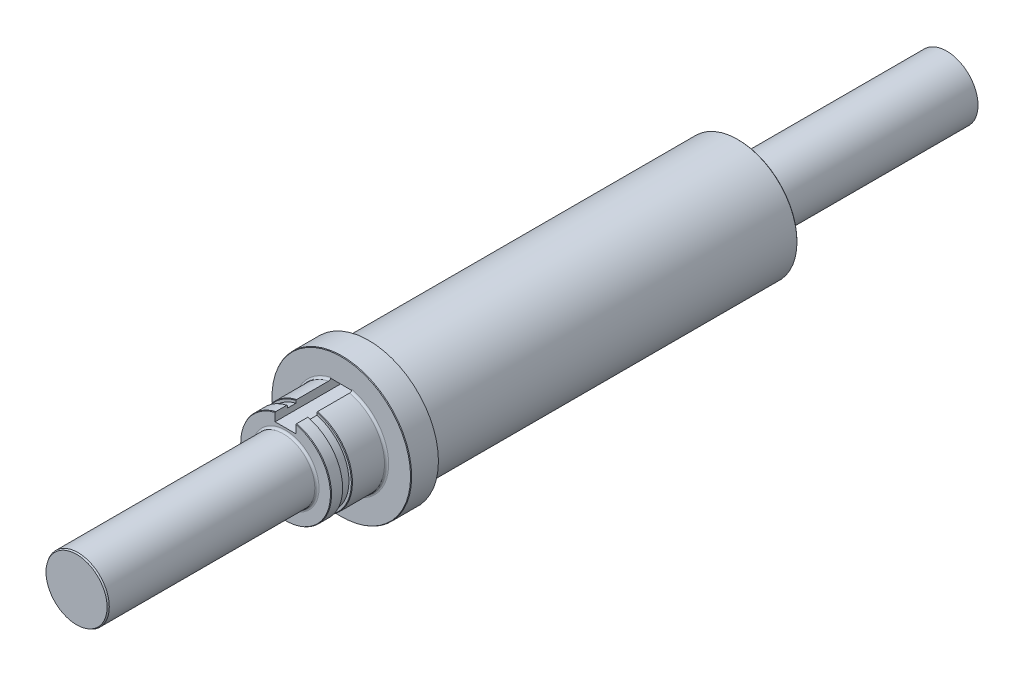
ISO-10303-21;
HEADER;
FILE_DESCRIPTION(('STEP AP214'),'2;1');
FILE_NAME('part.step','',(''),(''),'','','');
FILE_SCHEMA(('AUTOMOTIVE_DESIGN { 1 0 10303 214 1 1 1 1 }'));
ENDSEC;
DATA;
#1=APPLICATION_CONTEXT('core data for automotive mechanical design processes');
#2=APPLICATION_PROTOCOL_DEFINITION('international standard','automotive_design',2000,#1);
#3=PRODUCT_CONTEXT('',#1,'mechanical');
#4=PRODUCT('Part','Part','',(#3));
#5=PRODUCT_RELATED_PRODUCT_CATEGORY('part','',(#4));
#6=PRODUCT_DEFINITION_FORMATION('','',#4);
#7=PRODUCT_DEFINITION_CONTEXT('part definition',#1,'design');
#8=PRODUCT_DEFINITION('design','',#6,#7);
#9=PRODUCT_DEFINITION_SHAPE('','',#8);
#10=(LENGTH_UNIT() NAMED_UNIT(*) SI_UNIT(.MILLI.,.METRE.));
#11=(NAMED_UNIT(*) PLANE_ANGLE_UNIT() SI_UNIT($,.RADIAN.));
#12=(NAMED_UNIT(*) SI_UNIT($,.STERADIAN.) SOLID_ANGLE_UNIT());
#13=UNCERTAINTY_MEASURE_WITH_UNIT(LENGTH_MEASURE(1.E-05),#10,'distance_accuracy_value','');
#14=(GEOMETRIC_REPRESENTATION_CONTEXT(3) GLOBAL_UNCERTAINTY_ASSIGNED_CONTEXT((#13)) GLOBAL_UNIT_ASSIGNED_CONTEXT((#10,
#11,#12)) REPRESENTATION_CONTEXT('',''));
#15=CARTESIAN_POINT('',(0.,0.,0.));
#16=DIRECTION('',(0.,0.,1.));
#17=DIRECTION('',(1.,0.,0.));
#18=AXIS2_PLACEMENT_3D('',#15,#16,#17);
#19=CARTESIAN_POINT('',(-1.5,6.5,-45.));
#20=DIRECTION('',(-1.,0.,0.));
#21=DIRECTION('',(0.,-1.,0.));
#22=AXIS2_PLACEMENT_3D('',#19,#20,#21);
#23=PLANE('',#22);
#24=DIRECTION('',(0.,0.,1.));
#25=VECTOR('',#24,1.);
#26=CARTESIAN_POINT('',(-1.5,5.1,-45.));
#27=LINE('',#26,#25);
#28=CARTESIAN_POINT('',(-1.5,5.1,-42.));
#29=VERTEX_POINT('',#28);
#30=CARTESIAN_POINT('',(-1.5,5.1,-30.));
#31=VERTEX_POINT('',#30);
#32=EDGE_CURVE('E167',#29,#31,#27,.T.);
#33=ORIENTED_EDGE('',*,*,#32,.F.);
#34=DIRECTION('',(0.,-1.,0.));
#35=VECTOR('',#34,1.);
#36=CARTESIAN_POINT('',(-1.5,0.,-42.));
#37=LINE('',#36,#35);
#38=CARTESIAN_POINT('',(-1.5,6.5,-42.));
#39=VERTEX_POINT('',#38);
#40=EDGE_CURVE('E60',#39,#29,#37,.T.);
#41=ORIENTED_EDGE('',*,*,#40,.F.);
#42=DIRECTION('',(0.,0.,1.));
#43=VECTOR('',#42,1.);
#44=CARTESIAN_POINT('',(-1.5,6.5,-45.));
#45=LINE('',#44,#43);
#46=CARTESIAN_POINT('',(-1.5,6.5,-38.));
#47=VERTEX_POINT('',#46);
#48=EDGE_CURVE('E158',#39,#47,#45,.T.);
#49=ORIENTED_EDGE('',*,*,#48,.T.);
#50=DIRECTION('',(0.,-1.,0.));
#51=VECTOR('',#50,1.);
#52=CARTESIAN_POINT('',(-1.5,0.,-38.));
#53=LINE('',#52,#51);
#54=CARTESIAN_POINT('',(-1.5,6.63249575951622,-38.0000000000005));
#55=VERTEX_POINT('',#54);
#56=EDGE_CURVE('E423',#55,#47,#53,.T.);
#57=ORIENTED_EDGE('',*,*,#56,.F.);
#58=CARTESIAN_POINT('',(-1.5,6.32455532033676,-37.7));
#59=CARTESIAN_POINT('',(-1.5,6.32453903183683,-37.716553238349));
#60=CARTESIAN_POINT('',(-1.5,6.32596232798242,-37.7330993876585));
#61=CARTESIAN_POINT('',(-1.5,6.33156438144855,-37.7656923637573));
#62=CARTESIAN_POINT('',(-1.5,6.33573873815369,-37.7817399452011));
#63=CARTESIAN_POINT('',(-1.5,6.34672101624412,-37.8129095079956));
#64=CARTESIAN_POINT('',(-1.5,6.3535294633606,-37.828031303873));
#65=CARTESIAN_POINT('',(-1.5,6.36955801444457,-37.8569366748515));
#66=CARTESIAN_POINT('',(-1.5,6.37877833299269,-37.8707201307329));
#67=CARTESIAN_POINT('',(-1.5,6.39947525804169,-37.8967455606437));
#68=CARTESIAN_POINT('',(-1.5,6.41097768578736,-37.9089669844071));
#69=CARTESIAN_POINT('',(-1.5,6.43582547065724,-37.9313636676768));
#70=CARTESIAN_POINT('',(-1.5,6.44917100345746,-37.9415387319066));
#71=CARTESIAN_POINT('',(-1.5,6.47768690310887,-37.9598268689877));
#72=CARTESIAN_POINT('',(-1.5,6.49289488154221,-37.9678812927223));
#73=CARTESIAN_POINT('',(-1.5,6.52442818849014,-37.9813900776789));
#74=CARTESIAN_POINT('',(-1.5,6.54075385033451,-37.9868436593478));
#75=CARTESIAN_POINT('',(-1.5,6.57444918566688,-37.9951074774921));
#76=CARTESIAN_POINT('',(-1.5,6.59183404908084,-37.9978558069881));
#77=CARTESIAN_POINT('',(-1.5,6.62682566518354,-38.0004402462837));
#78=CARTESIAN_POINT('',(-1.5,6.64443250681044,-38.000275149171));
#79=CARTESIAN_POINT('',(-1.5,6.66190307065475,-37.9986253727531));
#80=B_SPLINE_CURVE_WITH_KNOTS('',3,(#58,#59,#60,#61,#62,#63,#64,#65,#66,#67,#68,#69,#70,#71,#72,
#73,#74,#75,#76,#77,#78,#79),.UNSPECIFIED.,.F.,.F.,(4,2,2,2,2,2,2,2,2,2,4),(0.,
0.0495879486286394,0.0990967679365956,0.148615473681593,0.198138586531624,0.248257766071645,
0.298381726035033,0.349773195383864,0.401180058684568,0.453737717525486,0.506317149343365),.UNSPECIFIED.);
#81=CARTESIAN_POINT('',(-1.5,6.32455532033676,-37.7));
#82=VERTEX_POINT('',#81);
#83=EDGE_CURVE('E429',#55,#82,#80,.F.);
#84=ORIENTED_EDGE('',*,*,#83,.T.);
#85=DIRECTION('',(0.,0.,1.));
#86=VECTOR('',#85,1.);
#87=CARTESIAN_POINT('',(-1.5,6.32455532033676,-95.));
#88=LINE('',#87,#86);
#89=CARTESIAN_POINT('',(-1.5,6.32455532033676,-33.1));
#90=VERTEX_POINT('',#89);
#91=EDGE_CURVE('E316',#82,#90,#88,.T.);
#92=ORIENTED_EDGE('',*,*,#91,.T.);
#93=CARTESIAN_POINT('',(-1.5,6.32455532033676,-33.1));
#94=CARTESIAN_POINT('',(-1.5,6.31466524430173,-33.0833322335719));
#95=CARTESIAN_POINT('',(-1.5,6.30477424178611,-33.0666650170247));
#96=CARTESIAN_POINT('',(-1.5,6.28499038379341,-33.0333316836914));
#97=CARTESIAN_POINT('',(-1.5,6.27509752831634,-33.0166655669053));
#98=CARTESIAN_POINT('',(-1.5,6.26520374635868,-33.));
#99=B_SPLINE_CURVE_WITH_KNOTS('',3,(#93,#94,#95,#96,#97,#98),.UNSPECIFIED.,.F.,.F.,(4,2,4),(0.,
0.0581433774713224,0.116286754944245),.UNSPECIFIED.);
#100=CARTESIAN_POINT('',(-1.5,6.26520374635868,-33.));
#101=VERTEX_POINT('',#100);
#102=EDGE_CURVE('E222',#90,#101,#99,.T.);
#103=ORIENTED_EDGE('',*,*,#102,.T.);
#104=DIRECTION('',(0.,1.,0.));
#105=VECTOR('',#104,1.);
#106=CARTESIAN_POINT('',(-1.5,6.5,-33.));
#107=LINE('',#106,#105);
#108=CARTESIAN_POINT('',(-1.5,5.9126981996378,-33.));
#109=VERTEX_POINT('',#108);
#110=EDGE_CURVE('E338',#109,#101,#107,.T.);
#111=ORIENTED_EDGE('',*,*,#110,.F.);
#112=DIRECTION('',(0.,0.,1.));
#113=VECTOR('',#112,1.);
#114=CARTESIAN_POINT('',(-1.5,5.91269819963779,0.));
#115=LINE('',#114,#113);
#116=CARTESIAN_POINT('',(-1.5,5.91269819963779,-31.75));
#117=VERTEX_POINT('',#116);
#118=EDGE_CURVE('E340',#117,#109,#115,.F.);
#119=ORIENTED_EDGE('',*,*,#118,.F.);
#120=DIRECTION('',(0.,-1.,0.));
#121=VECTOR('',#120,1.);
#122=CARTESIAN_POINT('',(-1.5,6.5,-31.75));
#123=LINE('',#122,#121);
#124=CARTESIAN_POINT('',(-1.5,6.22173609212092,-31.75));
#125=VERTEX_POINT('',#124);
#126=EDGE_CURVE('E336',#125,#117,#123,.T.);
#127=ORIENTED_EDGE('',*,*,#126,.F.);
#128=CARTESIAN_POINT('',(-1.5,6.22173609212092,-31.75));
#129=CARTESIAN_POINT('',(-1.5,6.23887445101876,-31.7403807382495));
#130=CARTESIAN_POINT('',(-1.5,6.25601189948626,-31.7307598551307));
#131=CARTESIAN_POINT('',(-1.5,6.29028497555821,-31.7115148461577));
#132=CARTESIAN_POINT('',(-1.5,6.30742060316265,-31.7018907203035));
#133=CARTESIAN_POINT('',(-1.5,6.32455532033676,-31.692264973081));
#134=B_SPLINE_CURVE_WITH_KNOTS('',3,(#128,#129,#130,#131,#132,#133),.UNSPECIFIED.,.F.,.F.,(4,2,
4),(0.,0.058960001591426,0.117920003174669),.UNSPECIFIED.);
#135=CARTESIAN_POINT('',(-1.5,6.32455532033676,-31.692264973081));
#136=VERTEX_POINT('',#135);
#137=EDGE_CURVE('E229',#125,#136,#134,.T.);
#138=ORIENTED_EDGE('',*,*,#137,.T.);
#139=CARTESIAN_POINT('',(-1.5,6.32455532033676,-30.1));
#140=VERTEX_POINT('',#139);
#141=EDGE_CURVE('E318',#136,#140,#88,.T.);
#142=ORIENTED_EDGE('',*,*,#141,.T.);
#143=CARTESIAN_POINT('',(-1.5,6.32455532033676,-30.1));
#144=CARTESIAN_POINT('',(-1.5,6.31466524430173,-30.0833322335719));
#145=CARTESIAN_POINT('',(-1.5,6.30477424178611,-30.0666650170247));
#146=CARTESIAN_POINT('',(-1.5,6.28499038379341,-30.0333316836914));
#147=CARTESIAN_POINT('',(-1.5,6.27509752831634,-30.0166655669053));
#148=CARTESIAN_POINT('',(-1.5,6.26520374635868,-30.));
#149=B_SPLINE_CURVE_WITH_KNOTS('',3,(#143,#144,#145,#146,#147,#148),.UNSPECIFIED.,.F.,.F.,(4,2,
4),(0.,0.0581433774713198,0.116286754944245),.UNSPECIFIED.);
#150=CARTESIAN_POINT('',(-1.5,6.26520374635868,-30.));
#151=VERTEX_POINT('',#150);
#152=EDGE_CURVE('E212',#140,#151,#149,.T.);
#153=ORIENTED_EDGE('',*,*,#152,.T.);
#154=DIRECTION('',(0.,-1.,0.));
#155=VECTOR('',#154,1.);
#156=CARTESIAN_POINT('',(-1.5,6.5,-30.));
#157=LINE('',#156,#155);
#158=EDGE_CURVE('E334',#151,#31,#157,.T.);
#159=ORIENTED_EDGE('',*,*,#158,.T.);
#160=EDGE_LOOP('',(#33,#41,#49,#57,#84,#92,#103,#111,#119,#127,#138,#142,#153,#159));
#161=FACE_BOUND('',#160,.T.);
#162=ADVANCED_FACE('F45',(#161),#23,.F.);
#163=CARTESIAN_POINT('',(1.5,6.5,-45.));
#164=DIRECTION('',(1.,0.,0.));
#165=DIRECTION('',(0.,1.,0.));
#166=AXIS2_PLACEMENT_3D('',#163,#164,#165);
#167=PLANE('',#166);
#168=DIRECTION('',(0.,1.,0.));
#169=VECTOR('',#168,1.);
#170=CARTESIAN_POINT('',(1.5,0.,-42.));
#171=LINE('',#170,#169);
#172=CARTESIAN_POINT('',(1.5,5.1,-42.));
#173=VERTEX_POINT('',#172);
#174=CARTESIAN_POINT('',(1.5,6.5,-42.));
#175=VERTEX_POINT('',#174);
#176=EDGE_CURVE('E148',#173,#175,#171,.T.);
#177=ORIENTED_EDGE('',*,*,#176,.F.);
#178=DIRECTION('',(0.,0.,1.));
#179=VECTOR('',#178,1.);
#180=CARTESIAN_POINT('',(1.5,5.1,-45.));
#181=LINE('',#180,#179);
#182=CARTESIAN_POINT('',(1.5,5.1,-30.));
#183=VERTEX_POINT('',#182);
#184=EDGE_CURVE('E152',#173,#183,#181,.T.);
#185=ORIENTED_EDGE('',*,*,#184,.T.);
#186=DIRECTION('',(0.,1.,0.));
#187=VECTOR('',#186,1.);
#188=CARTESIAN_POINT('',(1.5,6.5,-30.));
#189=LINE('',#188,#187);
#190=CARTESIAN_POINT('',(1.5,6.26520374635868,-30.));
#191=VERTEX_POINT('',#190);
#192=EDGE_CURVE('E327',#183,#191,#189,.T.);
#193=ORIENTED_EDGE('',*,*,#192,.T.);
#194=CARTESIAN_POINT('',(1.5,6.26520374635868,-30.));
#195=CARTESIAN_POINT('',(1.5,6.27509752831634,-30.0166655669053));
#196=CARTESIAN_POINT('',(1.5,6.28499038379341,-30.0333316836914));
#197=CARTESIAN_POINT('',(1.5,6.30477424178611,-30.0666650170247));
#198=CARTESIAN_POINT('',(1.5,6.31466524430173,-30.0833322335719));
#199=CARTESIAN_POINT('',(1.5,6.32455532033676,-30.1));
#200=B_SPLINE_CURVE_WITH_KNOTS('',3,(#194,#195,#196,#197,#198,#199),.UNSPECIFIED.,.F.,.F.,(4,2,
4),(0.,0.0581433774729256,0.116286754944245),.UNSPECIFIED.);
#201=CARTESIAN_POINT('',(1.5,6.32455532033676,-30.1));
#202=VERTEX_POINT('',#201);
#203=EDGE_CURVE('E264',#191,#202,#200,.T.);
#204=ORIENTED_EDGE('',*,*,#203,.T.);
#205=DIRECTION('',(0.,0.,1.));
#206=VECTOR('',#205,1.);
#207=CARTESIAN_POINT('',(1.5,6.32455532033676,-95.));
#208=LINE('',#207,#206);
#209=CARTESIAN_POINT('',(1.5,6.32455532033676,-31.692264973081));
#210=VERTEX_POINT('',#209);
#211=EDGE_CURVE('E319',#202,#210,#208,.F.);
#212=ORIENTED_EDGE('',*,*,#211,.T.);
#213=CARTESIAN_POINT('',(1.5,6.32455532033676,-31.692264973081));
#214=CARTESIAN_POINT('',(1.5,6.30742060316265,-31.7018907203035));
#215=CARTESIAN_POINT('',(1.5,6.2902849755582,-31.7115148461577));
#216=CARTESIAN_POINT('',(1.5,6.25601189948626,-31.7307598551307));
#217=CARTESIAN_POINT('',(1.5,6.23887445101875,-31.7403807382495));
#218=CARTESIAN_POINT('',(1.5,6.22173609212091,-31.75));
#219=B_SPLINE_CURVE_WITH_KNOTS('',3,(#213,#214,#215,#216,#217,#218),.UNSPECIFIED.,.F.,.F.,(4,2,
4),(0.,0.0589600015832439,0.11792000317467),.UNSPECIFIED.);
#220=CARTESIAN_POINT('',(1.5,6.22173609212092,-31.75));
#221=VERTEX_POINT('',#220);
#222=EDGE_CURVE('E250',#210,#221,#219,.T.);
#223=ORIENTED_EDGE('',*,*,#222,.T.);
#224=DIRECTION('',(0.,1.,0.));
#225=VECTOR('',#224,1.);
#226=CARTESIAN_POINT('',(1.5,6.5,-31.75));
#227=LINE('',#226,#225);
#228=CARTESIAN_POINT('',(1.5,5.91269819963779,-31.75));
#229=VERTEX_POINT('',#228);
#230=EDGE_CURVE('E309',#229,#221,#227,.T.);
#231=ORIENTED_EDGE('',*,*,#230,.F.);
#232=DIRECTION('',(0.,0.,1.));
#233=VECTOR('',#232,1.);
#234=CARTESIAN_POINT('',(1.5,5.91269819963779,0.));
#235=LINE('',#234,#233);
#236=CARTESIAN_POINT('',(1.5,5.91269819963779,-33.));
#237=VERTEX_POINT('',#236);
#238=EDGE_CURVE('E314',#237,#229,#235,.T.);
#239=ORIENTED_EDGE('',*,*,#238,.F.);
#240=DIRECTION('',(0.,-1.,0.));
#241=VECTOR('',#240,1.);
#242=CARTESIAN_POINT('',(1.5,6.5,-33.));
#243=LINE('',#242,#241);
#244=CARTESIAN_POINT('',(1.5,6.26520374635868,-33.));
#245=VERTEX_POINT('',#244);
#246=EDGE_CURVE('E312',#245,#237,#243,.T.);
#247=ORIENTED_EDGE('',*,*,#246,.F.);
#248=CARTESIAN_POINT('',(1.5,6.26520374635868,-33.));
#249=CARTESIAN_POINT('',(1.5,6.27509752831634,-33.0166655669053));
#250=CARTESIAN_POINT('',(1.5,6.28499038379341,-33.0333316836914));
#251=CARTESIAN_POINT('',(1.5,6.30477424178611,-33.0666650170247));
#252=CARTESIAN_POINT('',(1.5,6.31466524430173,-33.0833322335719));
#253=CARTESIAN_POINT('',(1.5,6.32455532033676,-33.1));
#254=B_SPLINE_CURVE_WITH_KNOTS('',3,(#248,#249,#250,#251,#252,#253),.UNSPECIFIED.,.F.,.F.,(4,2,
4),(0.,0.0581433774729218,0.116286754944245),.UNSPECIFIED.);
#255=CARTESIAN_POINT('',(1.5,6.32455532033676,-33.1));
#256=VERTEX_POINT('',#255);
#257=EDGE_CURVE('E271',#245,#256,#254,.T.);
#258=ORIENTED_EDGE('',*,*,#257,.T.);
#259=CARTESIAN_POINT('',(1.5,6.32455532033676,-37.7));
#260=VERTEX_POINT('',#259);
#261=EDGE_CURVE('E321',#256,#260,#208,.F.);
#262=ORIENTED_EDGE('',*,*,#261,.T.);
#263=CARTESIAN_POINT('',(1.5,6.32455532033676,-37.7));
#264=CARTESIAN_POINT('',(1.5,6.32453903183683,-37.716553238349));
#265=CARTESIAN_POINT('',(1.5,6.32596232798242,-37.7330993876585));
#266=CARTESIAN_POINT('',(1.5,6.33156438144855,-37.7656923637573));
#267=CARTESIAN_POINT('',(1.5,6.33573873815369,-37.7817399452011));
#268=CARTESIAN_POINT('',(1.5,6.34672101624412,-37.8129095079956));
#269=CARTESIAN_POINT('',(1.5,6.3535294633606,-37.828031303873));
#270=CARTESIAN_POINT('',(1.5,6.36955801444457,-37.8569366748515));
#271=CARTESIAN_POINT('',(1.5,6.37877833299269,-37.8707201307329));
#272=CARTESIAN_POINT('',(1.5,6.39947525804169,-37.8967455606437));
#273=CARTESIAN_POINT('',(1.5,6.41097768578736,-37.9089669844071));
#274=CARTESIAN_POINT('',(1.5,6.43582547065724,-37.9313636676768));
#275=CARTESIAN_POINT('',(1.5,6.44917100345746,-37.9415387319066));
#276=CARTESIAN_POINT('',(1.5,6.47768690310887,-37.9598268689877));
#277=CARTESIAN_POINT('',(1.5,6.49289488154221,-37.9678812927223));
#278=CARTESIAN_POINT('',(1.5,6.52442818849014,-37.9813900776789));
#279=CARTESIAN_POINT('',(1.5,6.54075385033451,-37.9868436593478));
#280=CARTESIAN_POINT('',(1.5,6.57444918566688,-37.9951074774921));
#281=CARTESIAN_POINT('',(1.5,6.59183404908084,-37.9978558069881));
#282=CARTESIAN_POINT('',(1.5,6.62682566518354,-38.0004402462837));
#283=CARTESIAN_POINT('',(1.5,6.64443250681044,-38.000275149171));
#284=CARTESIAN_POINT('',(1.5,6.66190307065475,-37.9986253727531));
#285=B_SPLINE_CURVE_WITH_KNOTS('',3,(#263,#264,#265,#266,#267,#268,#269,#270,#271,#272,#273,
#274,#275,#276,#277,#278,#279,#280,#281,#282,#283,#284),.UNSPECIFIED.,.F.,.F.,(4,2,2,2,2,2,2,2,
2,2,4),(0.,0.0495879486286394,0.0990967679365956,0.148615473681593,0.198138586531624,
0.248257766071645,0.298381726035033,0.349773195383864,0.401180058684568,0.453737717525486,
0.506317149343365),.UNSPECIFIED.);
#286=CARTESIAN_POINT('',(1.5,6.63249575951622,-38.));
#287=VERTEX_POINT('',#286);
#288=EDGE_CURVE('E433',#260,#287,#285,.T.);
#289=ORIENTED_EDGE('',*,*,#288,.T.);
#290=DIRECTION('',(0.,1.,0.));
#291=VECTOR('',#290,1.);
#292=CARTESIAN_POINT('',(1.5,0.,-38.));
#293=LINE('',#292,#291);
#294=CARTESIAN_POINT('',(1.5,6.5,-38.));
#295=VERTEX_POINT('',#294);
#296=EDGE_CURVE('E68',#295,#287,#293,.T.);
#297=ORIENTED_EDGE('',*,*,#296,.F.);
#298=DIRECTION('',(0.,0.,1.));
#299=VECTOR('',#298,1.);
#300=CARTESIAN_POINT('',(1.5,6.5,-45.));
#301=LINE('',#300,#299);
#302=EDGE_CURVE('E155',#175,#295,#301,.T.);
#303=ORIENTED_EDGE('',*,*,#302,.F.);
#304=EDGE_LOOP('',(#177,#185,#193,#204,#212,#223,#231,#239,#247,#258,#262,#289,#297,#303));
#305=FACE_BOUND('',#304,.T.);
#306=ADVANCED_FACE('F150',(#305),#167,.F.);
#307=CARTESIAN_POINT('',(-1.5,5.1,-45.));
#308=DIRECTION('',(0.,-1.,0.));
#309=DIRECTION('',(0.,0.,-1.));
#310=AXIS2_PLACEMENT_3D('',#307,#308,#309);
#311=PLANE('',#310);
#312=DIRECTION('',(1.,0.,0.));
#313=VECTOR('',#312,1.);
#314=CARTESIAN_POINT('',(-1.5,5.1,-42.));
#315=LINE('',#314,#313);
#316=EDGE_CURVE('E162',#29,#173,#315,.T.);
#317=ORIENTED_EDGE('',*,*,#316,.F.);
#318=ORIENTED_EDGE('',*,*,#32,.T.);
#319=DIRECTION('',(1.,0.,0.));
#320=VECTOR('',#319,1.);
#321=CARTESIAN_POINT('',(-1.5,5.1,-30.));
#322=LINE('',#321,#320);
#323=EDGE_CURVE('E165',#31,#183,#322,.T.);
#324=ORIENTED_EDGE('',*,*,#323,.T.);
#325=ORIENTED_EDGE('',*,*,#184,.F.);
#326=EDGE_LOOP('',(#317,#318,#324,#325));
#327=FACE_BOUND('',#326,.T.);
#328=ADVANCED_FACE('F161',(#327),#311,.F.);
#329=CARTESIAN_POINT('',(0.,0.,-95.));
#330=DIRECTION('',(0.,0.,1.));
#331=DIRECTION('',(1.,0.,0.));
#332=AXIS2_PLACEMENT_3D('',#329,#330,#331);
#333=CYLINDRICAL_SURFACE('',#332,6.5);
#334=ORIENTED_EDGE('',*,*,#141,.F.);
#335=CARTESIAN_POINT('',(0.,0.,-31.692264973081));
#336=DIRECTION('',(0.,0.,-1.));
#337=DIRECTION('',(-1.,0.,0.));
#338=AXIS2_PLACEMENT_3D('',#335,#336,#337);
#339=CIRCLE('',#338,6.5);
#340=EDGE_CURVE('E255',#136,#210,#339,.F.);
#341=ORIENTED_EDGE('',*,*,#340,.T.);
#342=ORIENTED_EDGE('',*,*,#211,.F.);
#343=CARTESIAN_POINT('',(0.,0.,-30.1));
#344=DIRECTION('',(0.,0.,1.));
#345=DIRECTION('',(1.,0.,0.));
#346=AXIS2_PLACEMENT_3D('',#343,#344,#345);
#347=CIRCLE('',#346,6.5);
#348=EDGE_CURVE('E288',#202,#140,#347,.F.);
#349=ORIENTED_EDGE('',*,*,#348,.T.);
#350=EDGE_LOOP('',(#334,#341,#342,#349));
#351=FACE_BOUND('',#350,.T.);
#352=ADVANCED_FACE('F359',(#351),#333,.T.);
#353=ORIENTED_EDGE('',*,*,#91,.F.);
#354=CARTESIAN_POINT('',(0.,0.,-37.7));
#355=DIRECTION('',(0.,0.,1.));
#356=DIRECTION('',(1.,0.,0.));
#357=AXIS2_PLACEMENT_3D('',#354,#355,#356);
#358=CIRCLE('',#357,6.5);
#359=EDGE_CURVE('E432',#82,#260,#358,.T.);
#360=ORIENTED_EDGE('',*,*,#359,.T.);
#361=ORIENTED_EDGE('',*,*,#261,.F.);
#362=CARTESIAN_POINT('',(0.,0.,-33.1));
#363=DIRECTION('',(0.,0.,1.));
#364=DIRECTION('',(1.,0.,0.));
#365=AXIS2_PLACEMENT_3D('',#362,#363,#364);
#366=CIRCLE('',#365,6.5);
#367=EDGE_CURVE('E280',#256,#90,#366,.F.);
#368=ORIENTED_EDGE('',*,*,#367,.T.);
#369=EDGE_LOOP('',(#353,#360,#361,#368));
#370=FACE_BOUND('',#369,.T.);
#371=ADVANCED_FACE('F399',(#370),#333,.T.);
#372=CARTESIAN_POINT('',(0.,0.,-42.));
#373=DIRECTION('',(0.,0.,1.));
#374=DIRECTION('',(1.,0.,0.));
#375=AXIS2_PLACEMENT_3D('',#372,#373,#374);
#376=CYLINDRICAL_SURFACE('',#375,10.);
#377=CARTESIAN_POINT('',(0.,0.,-41.942264973081));
#378=DIRECTION('',(0.,0.,1.));
#379=DIRECTION('',(1.,0.,0.));
#380=AXIS2_PLACEMENT_3D('',#377,#378,#379);
#381=CIRCLE('',#380,10.);
#382=CARTESIAN_POINT('',(10.,0.,-41.942264973081));
#383=VERTEX_POINT('',#382);
#384=EDGE_CURVE('E434',#383,#383,#381,.T.);
#385=ORIENTED_EDGE('',*,*,#384,.T.);
#386=EDGE_LOOP('',(#385));
#387=FACE_BOUND('',#386,.T.);
#388=CARTESIAN_POINT('',(0.,0.,-38.1));
#389=DIRECTION('',(0.,0.,1.));
#390=DIRECTION('',(1.,0.,0.));
#391=AXIS2_PLACEMENT_3D('',#388,#389,#390);
#392=CIRCLE('',#391,10.);
#393=CARTESIAN_POINT('',(10.,0.,-38.1));
#394=VERTEX_POINT('',#393);
#395=EDGE_CURVE('E490',#394,#394,#392,.F.);
#396=ORIENTED_EDGE('',*,*,#395,.T.);
#397=EDGE_LOOP('',(#396));
#398=FACE_BOUND('',#397,.T.);
#399=ADVANCED_FACE('F407',(#387,#398),#376,.T.);
#400=CARTESIAN_POINT('',(0.,0.,-42.));
#401=DIRECTION('',(0.,0.,1.));
#402=DIRECTION('',(1.,0.,0.));
#403=AXIS2_PLACEMENT_3D('',#400,#401,#402);
#404=PLANE('',#403);
#405=CARTESIAN_POINT('',(0.,0.,-42.));
#406=DIRECTION('',(0.,0.,1.));
#407=DIRECTION('',(1.,0.,0.));
#408=AXIS2_PLACEMENT_3D('',#405,#406,#407);
#409=CIRCLE('',#408,8.8);
#410=CARTESIAN_POINT('',(8.8,0.,-42.));
#411=VERTEX_POINT('',#410);
#412=EDGE_CURVE('E13',#411,#411,#409,.T.);
#413=ORIENTED_EDGE('',*,*,#412,.T.);
#414=EDGE_LOOP('',(#413));
#415=FACE_BOUND('',#414,.T.);
#416=CARTESIAN_POINT('',(0.,0.,-42.));
#417=DIRECTION('',(0.,0.,1.));
#418=DIRECTION('',(1.,0.,0.));
#419=AXIS2_PLACEMENT_3D('',#416,#417,#418);
#420=CIRCLE('',#419,9.90000000000001);
#421=CARTESIAN_POINT('',(9.90000000000001,0.,-42.));
#422=VERTEX_POINT('',#421);
#423=EDGE_CURVE('E482',#422,#422,#420,.F.);
#424=ORIENTED_EDGE('',*,*,#423,.T.);
#425=EDGE_LOOP('',(#424));
#426=FACE_BOUND('',#425,.T.);
#427=ADVANCED_FACE('F207',(#415,#426),#404,.F.);
#428=CARTESIAN_POINT('',(0.,0.,-38.));
#429=DIRECTION('',(0.,0.,1.));
#430=DIRECTION('',(1.,0.,0.));
#431=AXIS2_PLACEMENT_3D('',#428,#429,#430);
#432=PLANE('',#431);
#433=CARTESIAN_POINT('',(0.,0.,-38.));
#434=DIRECTION('',(0.,0.,1.));
#435=DIRECTION('',(1.,0.,0.));
#436=AXIS2_PLACEMENT_3D('',#433,#434,#435);
#437=CIRCLE('',#436,9.94226497308104);
#438=CARTESIAN_POINT('',(9.94226497308104,0.,-38.));
#439=VERTEX_POINT('',#438);
#440=EDGE_CURVE('E236',#439,#439,#437,.T.);
#441=ORIENTED_EDGE('',*,*,#440,.T.);
#442=EDGE_LOOP('',(#441));
#443=FACE_BOUND('',#442,.T.);
#444=CARTESIAN_POINT('',(0.,0.,-38.));
#445=DIRECTION('',(0.,0.,1.));
#446=DIRECTION('',(1.,0.,0.));
#447=AXIS2_PLACEMENT_3D('',#444,#445,#446);
#448=CIRCLE('',#447,6.8);
#449=CARTESIAN_POINT('',(1.56923076923077,6.61645787358307,-38.));
#450=VERTEX_POINT('',#449);
#451=EDGE_CURVE('E421',#450,#55,#448,.F.);
#452=ORIENTED_EDGE('',*,*,#451,.T.);
#453=ORIENTED_EDGE('',*,*,#56,.T.);
#454=DIRECTION('',(-1.,0.,0.));
#455=VECTOR('',#454,1.);
#456=CARTESIAN_POINT('',(0.,6.5,-38.));
#457=LINE('',#456,#455);
#458=EDGE_CURVE('E157',#295,#47,#457,.T.);
#459=ORIENTED_EDGE('',*,*,#458,.F.);
#460=ORIENTED_EDGE('',*,*,#296,.T.);
#461=CARTESIAN_POINT('',(0.,0.,-38.));
#462=DIRECTION('',(0.,0.,1.));
#463=DIRECTION('',(1.,0.,0.));
#464=AXIS2_PLACEMENT_3D('',#461,#462,#463);
#465=CIRCLE('',#464,6.8);
#466=EDGE_CURVE('E425',#287,#450,#465,.F.);
#467=ORIENTED_EDGE('',*,*,#466,.T.);
#468=EDGE_LOOP('',(#452,#453,#459,#460,#467));
#469=FACE_BOUND('',#468,.T.);
#470=ADVANCED_FACE('F390',(#443,#469),#432,.T.);
#471=CARTESIAN_POINT('',(0.,0.,0.));
#472=DIRECTION('',(0.,0.,1.));
#473=DIRECTION('',(1.,0.,0.));
#474=AXIS2_PLACEMENT_3D('',#471,#472,#473);
#475=PLANE('',#474);
#476=CARTESIAN_POINT('',(0.,0.,0.));
#477=DIRECTION('',(0.,0.,1.));
#478=DIRECTION('',(1.,0.,0.));
#479=AXIS2_PLACEMENT_3D('',#476,#477,#478);
#480=CIRCLE('',#479,4.38452994616209);
#481=CARTESIAN_POINT('',(-4.38452994616209,0.,0.));
#482=VERTEX_POINT('',#481);
#483=EDGE_CURVE('E177',#482,#482,#480,.T.);
#484=ORIENTED_EDGE('',*,*,#483,.T.);
#485=EDGE_LOOP('',(#484));
#486=FACE_BOUND('',#485,.T.);
#487=ADVANCED_FACE('F385',(#486),#475,.T.);
#488=CARTESIAN_POINT('',(0.,0.,-125.));
#489=DIRECTION('',(0.,0.,1.));
#490=DIRECTION('',(1.,0.,0.));
#491=AXIS2_PLACEMENT_3D('',#488,#489,#490);
#492=CYLINDRICAL_SURFACE('',#491,4.5);
#493=CARTESIAN_POINT('',(0.,0.,-0.199999999999978));
#494=DIRECTION('',(0.,0.,1.));
#495=DIRECTION('',(1.,0.,0.));
#496=AXIS2_PLACEMENT_3D('',#493,#494,#495);
#497=CIRCLE('',#496,4.5);
#498=CARTESIAN_POINT('',(-4.5,0.,-0.199999999999978));
#499=VERTEX_POINT('',#498);
#500=EDGE_CURVE('E171',#499,#499,#497,.F.);
#501=ORIENTED_EDGE('',*,*,#500,.T.);
#502=EDGE_LOOP('',(#501));
#503=FACE_BOUND('',#502,.T.);
#504=CARTESIAN_POINT('',(0.,0.,-29.7));
#505=DIRECTION('',(0.,0.,1.));
#506=DIRECTION('',(1.,0.,0.));
#507=AXIS2_PLACEMENT_3D('',#504,#505,#506);
#508=CIRCLE('',#507,4.5);
#509=CARTESIAN_POINT('',(4.5,0.,-29.7));
#510=VERTEX_POINT('',#509);
#511=EDGE_CURVE('E300',#510,#510,#508,.T.);
#512=ORIENTED_EDGE('',*,*,#511,.T.);
#513=EDGE_LOOP('',(#512));
#514=FACE_BOUND('',#513,.T.);
#515=ADVANCED_FACE('F381',(#503,#514),#492,.T.);
#516=CARTESIAN_POINT('',(0.,0.,-30.));
#517=DIRECTION('',(0.,0.,1.));
#518=DIRECTION('',(1.,0.,0.));
#519=AXIS2_PLACEMENT_3D('',#516,#517,#518);
#520=PLANE('',#519);
#521=CARTESIAN_POINT('',(0.,0.,-30.));
#522=DIRECTION('',(0.,0.,1.));
#523=DIRECTION('',(1.,0.,0.));
#524=AXIS2_PLACEMENT_3D('',#521,#522,#523);
#525=CIRCLE('',#524,4.8);
#526=CARTESIAN_POINT('',(4.8,0.,-30.));
#527=VERTEX_POINT('',#526);
#528=EDGE_CURVE('E304',#527,#527,#525,.F.);
#529=ORIENTED_EDGE('',*,*,#528,.T.);
#530=EDGE_LOOP('',(#529));
#531=FACE_BOUND('',#530,.T.);
#532=ORIENTED_EDGE('',*,*,#158,.F.);
#533=CARTESIAN_POINT('',(0.,0.,-30.));
#534=DIRECTION('',(0.,0.,1.));
#535=DIRECTION('',(1.,0.,0.));
#536=AXIS2_PLACEMENT_3D('',#533,#534,#535);
#537=CIRCLE('',#536,6.44226497308104);
#538=EDGE_CURVE('E297',#151,#191,#537,.T.);
#539=ORIENTED_EDGE('',*,*,#538,.T.);
#540=ORIENTED_EDGE('',*,*,#192,.F.);
#541=ORIENTED_EDGE('',*,*,#323,.F.);
#542=EDGE_LOOP('',(#532,#539,#540,#541));
#543=FACE_BOUND('',#542,.T.);
#544=ADVANCED_FACE('F384',(#531,#543),#520,.T.);
#545=CARTESIAN_POINT('',(1.5,6.5,-45.));
#546=DIRECTION('',(0.,1.,0.));
#547=DIRECTION('',(0.,0.,1.));
#548=AXIS2_PLACEMENT_3D('',#545,#546,#547);
#549=PLANE('',#548);
#550=ORIENTED_EDGE('',*,*,#302,.T.);
#551=ORIENTED_EDGE('',*,*,#458,.T.);
#552=ORIENTED_EDGE('',*,*,#48,.F.);
#553=DIRECTION('',(-1.,0.,0.));
#554=VECTOR('',#553,1.);
#555=CARTESIAN_POINT('',(0.,6.5,-42.));
#556=LINE('',#555,#554);
#557=EDGE_CURVE('E323',#175,#39,#556,.T.);
#558=ORIENTED_EDGE('',*,*,#557,.F.);
#559=EDGE_LOOP('',(#550,#551,#552,#558));
#560=FACE_BOUND('',#559,.T.);
#561=ADVANCED_FACE('F259',(#560),#549,.F.);
#562=CARTESIAN_POINT('',(-6.1,0.,-31.75));
#563=DIRECTION('',(0.,0.,-1.));
#564=DIRECTION('',(-1.,0.,0.));
#565=AXIS2_PLACEMENT_3D('',#562,#563,#564);
#566=PLANE('',#565);
#567=ORIENTED_EDGE('',*,*,#230,.T.);
#568=CARTESIAN_POINT('',(0.,0.,-31.75));
#569=DIRECTION('',(0.,0.,-1.));
#570=DIRECTION('',(-1.,0.,0.));
#571=AXIS2_PLACEMENT_3D('',#568,#569,#570);
#572=CIRCLE('',#571,6.4);
#573=EDGE_CURVE('E237',#221,#125,#572,.T.);
#574=ORIENTED_EDGE('',*,*,#573,.T.);
#575=ORIENTED_EDGE('',*,*,#126,.T.);
#576=CARTESIAN_POINT('',(0.,0.,-31.75));
#577=DIRECTION('',(0.,0.,1.));
#578=DIRECTION('',(1.,0.,0.));
#579=AXIS2_PLACEMENT_3D('',#576,#577,#578);
#580=CIRCLE('',#579,6.1);
#581=EDGE_CURVE('E345',#117,#229,#580,.T.);
#582=ORIENTED_EDGE('',*,*,#581,.T.);
#583=EDGE_LOOP('',(#567,#574,#575,#582));
#584=FACE_BOUND('',#583,.T.);
#585=ADVANCED_FACE('F350',(#584),#566,.T.);
#586=CARTESIAN_POINT('',(-7.5,0.,-33.));
#587=DIRECTION('',(0.,0.,1.));
#588=DIRECTION('',(1.,0.,0.));
#589=AXIS2_PLACEMENT_3D('',#586,#587,#588);
#590=PLANE('',#589);
#591=ORIENTED_EDGE('',*,*,#110,.T.);
#592=CARTESIAN_POINT('',(0.,0.,-33.));
#593=DIRECTION('',(0.,0.,1.));
#594=DIRECTION('',(1.,0.,0.));
#595=AXIS2_PLACEMENT_3D('',#592,#593,#594);
#596=CIRCLE('',#595,6.44226497308104);
#597=EDGE_CURVE('E275',#101,#245,#596,.T.);
#598=ORIENTED_EDGE('',*,*,#597,.T.);
#599=ORIENTED_EDGE('',*,*,#246,.T.);
#600=CARTESIAN_POINT('',(0.,0.,-33.));
#601=DIRECTION('',(0.,0.,1.));
#602=DIRECTION('',(1.,0.,0.));
#603=AXIS2_PLACEMENT_3D('',#600,#601,#602);
#604=CIRCLE('',#603,6.1);
#605=EDGE_CURVE('E342',#109,#237,#604,.T.);
#606=ORIENTED_EDGE('',*,*,#605,.F.);
#607=EDGE_LOOP('',(#591,#598,#599,#606));
#608=FACE_BOUND('',#607,.T.);
#609=ADVANCED_FACE('F362',(#608),#590,.T.);
#610=CARTESIAN_POINT('',(0.,0.,0.));
#611=DIRECTION('',(0.,0.,1.));
#612=DIRECTION('',(1.,0.,0.));
#613=AXIS2_PLACEMENT_3D('',#610,#611,#612);
#614=CYLINDRICAL_SURFACE('',#613,6.1);
#615=ORIENTED_EDGE('',*,*,#118,.T.);
#616=ORIENTED_EDGE('',*,*,#605,.T.);
#617=ORIENTED_EDGE('',*,*,#238,.T.);
#618=ORIENTED_EDGE('',*,*,#581,.F.);
#619=EDGE_LOOP('',(#615,#616,#617,#618));
#620=FACE_BOUND('',#619,.T.);
#621=ADVANCED_FACE('F361',(#620),#614,.T.);
#622=CARTESIAN_POINT('',(0.,0.,-29.7));
#623=DIRECTION('',(0.,0.,1.));
#624=DIRECTION('',(1.,0.,0.));
#625=AXIS2_PLACEMENT_3D('',#622,#623,#624);
#626=TOROIDAL_SURFACE('',#625,4.8,0.3);
#627=ORIENTED_EDGE('',*,*,#511,.F.);
#628=EDGE_LOOP('',(#627));
#629=FACE_BOUND('',#628,.T.);
#630=ORIENTED_EDGE('',*,*,#528,.F.);
#631=EDGE_LOOP('',(#630));
#632=FACE_BOUND('',#631,.T.);
#633=ADVANCED_FACE('F371',(#629,#632),#626,.F.);
#634=CARTESIAN_POINT('',(0.,0.,-30.));
#635=DIRECTION('',(0.,0.,-1.));
#636=DIRECTION('',(-1.,0.,0.));
#637=AXIS2_PLACEMENT_3D('',#634,#635,#636);
#638=CONICAL_SURFACE('',#637,6.44226497308104,0.523598775598305);
#639=ORIENTED_EDGE('',*,*,#152,.F.);
#640=ORIENTED_EDGE('',*,*,#348,.F.);
#641=ORIENTED_EDGE('',*,*,#203,.F.);
#642=ORIENTED_EDGE('',*,*,#538,.F.);
#643=EDGE_LOOP('',(#639,#640,#641,#642));
#644=FACE_BOUND('',#643,.T.);
#645=ADVANCED_FACE('F367',(#644),#638,.T.);
#646=CARTESIAN_POINT('',(0.,0.,-33.1));
#647=DIRECTION('',(0.,0.,-1.));
#648=DIRECTION('',(-1.,0.,0.));
#649=AXIS2_PLACEMENT_3D('',#646,#647,#648);
#650=CONICAL_SURFACE('',#649,6.5,0.523598775598292);
#651=ORIENTED_EDGE('',*,*,#257,.F.);
#652=ORIENTED_EDGE('',*,*,#597,.F.);
#653=ORIENTED_EDGE('',*,*,#102,.F.);
#654=ORIENTED_EDGE('',*,*,#367,.F.);
#655=EDGE_LOOP('',(#651,#652,#653,#654));
#656=FACE_BOUND('',#655,.T.);
#657=ADVANCED_FACE('F245',(#656),#650,.T.);
#658=CARTESIAN_POINT('',(0.,0.,-31.692264973081));
#659=DIRECTION('',(0.,0.,1.));
#660=DIRECTION('',(1.,0.,0.));
#661=AXIS2_PLACEMENT_3D('',#658,#659,#660);
#662=CONICAL_SURFACE('',#661,6.5,1.04719755119653);
#663=ORIENTED_EDGE('',*,*,#137,.F.);
#664=ORIENTED_EDGE('',*,*,#573,.F.);
#665=ORIENTED_EDGE('',*,*,#222,.F.);
#666=ORIENTED_EDGE('',*,*,#340,.F.);
#667=EDGE_LOOP('',(#663,#664,#665,#666));
#668=FACE_BOUND('',#667,.T.);
#669=ADVANCED_FACE('F240',(#668),#662,.T.);
#670=CARTESIAN_POINT('',(0.,0.,-38.));
#671=DIRECTION('',(0.,0.,-1.));
#672=DIRECTION('',(-1.,0.,0.));
#673=AXIS2_PLACEMENT_3D('',#670,#671,#672);
#674=CONICAL_SURFACE('',#673,9.94226497308104,0.523598775598189);
#675=ORIENTED_EDGE('',*,*,#395,.F.);
#676=EDGE_LOOP('',(#675));
#677=FACE_BOUND('',#676,.T.);
#678=ORIENTED_EDGE('',*,*,#440,.F.);
#679=EDGE_LOOP('',(#678));
#680=FACE_BOUND('',#679,.T.);
#681=ADVANCED_FACE('F244',(#677,#680),#674,.T.);
#682=CARTESIAN_POINT('',(0.,0.,-37.7));
#683=DIRECTION('',(0.,0.,1.));
#684=DIRECTION('',(1.,0.,0.));
#685=AXIS2_PLACEMENT_3D('',#682,#683,#684);
#686=TOROIDAL_SURFACE('',#685,6.8,0.3);
#687=ORIENTED_EDGE('',*,*,#288,.F.);
#688=ORIENTED_EDGE('',*,*,#359,.F.);
#689=ORIENTED_EDGE('',*,*,#83,.F.);
#690=ORIENTED_EDGE('',*,*,#451,.F.);
#691=ORIENTED_EDGE('',*,*,#466,.F.);
#692=EDGE_LOOP('',(#687,#688,#689,#690,#691));
#693=FACE_BOUND('',#692,.T.);
#694=ADVANCED_FACE('F431',(#693),#686,.F.);
#695=CARTESIAN_POINT('',(0.,0.,-41.942264973081));
#696=DIRECTION('',(0.,0.,1.));
#697=DIRECTION('',(1.,0.,0.));
#698=AXIS2_PLACEMENT_3D('',#695,#696,#697);
#699=CONICAL_SURFACE('',#698,10.,1.04719755119652);
#700=ORIENTED_EDGE('',*,*,#423,.F.);
#701=EDGE_LOOP('',(#700));
#702=FACE_BOUND('',#701,.T.);
#703=ORIENTED_EDGE('',*,*,#384,.F.);
#704=EDGE_LOOP('',(#703));
#705=FACE_BOUND('',#704,.T.);
#706=ADVANCED_FACE('F447',(#702,#705),#699,.T.);
#707=CARTESIAN_POINT('',(0.,0.,0.));
#708=DIRECTION('',(0.,0.,-1.));
#709=DIRECTION('',(-1.,0.,0.));
#710=AXIS2_PLACEMENT_3D('',#707,#708,#709);
#711=CONICAL_SURFACE('',#710,4.38452994616209,0.523598775598284);
#712=CARTESIAN_POINT('',(-4.5,0.,-0.199999999999978));
#713=CARTESIAN_POINT('',(-4.49879718693919,0.,-0.197916666666645));
#714=CARTESIAN_POINT('',(-4.49759437387838,0.,-0.195833333333312));
#715=CARTESIAN_POINT('',(-4.49518874775675,0.,-0.191666666666646));
#716=CARTESIAN_POINT('',(-4.49398593469594,0.,-0.189583333333312));
#717=CARTESIAN_POINT('',(-4.49158030857432,0.,-0.185416666666646));
#718=CARTESIAN_POINT('',(-4.49037749551351,0.,-0.183333333333313));
#719=CARTESIAN_POINT('',(-4.48797186939188,0.,-0.179166666666647));
#720=CARTESIAN_POINT('',(-4.48676905633107,0.,-0.177083333333314));
#721=CARTESIAN_POINT('',(-4.48436343020945,0.,-0.172916666666648));
#722=CARTESIAN_POINT('',(-4.48316061714864,0.,-0.170833333333315));
#723=CARTESIAN_POINT('',(-4.48075499102701,0.,-0.166666666666648));
#724=CARTESIAN_POINT('',(-4.4795521779662,0.,-0.164583333333315));
#725=CARTESIAN_POINT('',(-4.47714655184458,0.,-0.160416666666649));
#726=CARTESIAN_POINT('',(-4.47594373878377,0.,-0.158333333333316));
#727=CARTESIAN_POINT('',(-4.47353811266214,0.,-0.15416666666665));
#728=CARTESIAN_POINT('',(-4.47233529960133,0.,-0.152083333333317));
#729=CARTESIAN_POINT('',(-4.46992967347971,0.,-0.14791666666665));
#730=CARTESIAN_POINT('',(-4.4687268604189,0.,-0.145833333333317));
#731=CARTESIAN_POINT('',(-4.46632123429728,0.,-0.141666666666651));
#732=CARTESIAN_POINT('',(-4.46511842123646,0.,-0.139583333333318));
#733=CARTESIAN_POINT('',(-4.46271279511484,0.,-0.135416666666652));
#734=CARTESIAN_POINT('',(-4.46150998205403,0.,-0.133333333333319));
#735=CARTESIAN_POINT('',(-4.45910435593241,0.,-0.129166666666652));
#736=CARTESIAN_POINT('',(-4.4579015428716,0.,-0.127083333333319));
#737=CARTESIAN_POINT('',(-4.45549591674997,0.,-0.122916666666653));
#738=CARTESIAN_POINT('',(-4.45429310368916,0.,-0.12083333333332));
#739=CARTESIAN_POINT('',(-4.45188747756754,0.,-0.116666666666654));
#740=CARTESIAN_POINT('',(-4.45068466450673,0.,-0.114583333333321));
#741=CARTESIAN_POINT('',(-4.4482790383851,0.,-0.110416666666655));
#742=CARTESIAN_POINT('',(-4.44707622532429,0.,-0.108333333333321));
#743=CARTESIAN_POINT('',(-4.44467059920267,0.,-0.104166666666655));
#744=CARTESIAN_POINT('',(-4.44346778614186,0.,-0.102083333333322));
#745=CARTESIAN_POINT('',(-4.44106216002023,0.,-0.0979166666666558));
#746=CARTESIAN_POINT('',(-4.43985934695942,0.,-0.0958333333333228));
#747=CARTESIAN_POINT('',(-4.4374537208378,0.,-0.0916666666666566));
#748=CARTESIAN_POINT('',(-4.43625090777699,0.,-0.0895833333333235));
#749=CARTESIAN_POINT('',(-4.43384528165536,0.,-0.0854166666666573));
#750=CARTESIAN_POINT('',(-4.43264246859455,0.,-0.0833333333333242));
#751=CARTESIAN_POINT('',(-4.43023684247293,0.,-0.079166666666658));
#752=CARTESIAN_POINT('',(-4.42903402941212,0.,-0.0770833333333249));
#753=CARTESIAN_POINT('',(-4.4266284032905,0.,-0.0729166666666586));
#754=CARTESIAN_POINT('',(-4.42542559022968,0.,-0.0708333333333255));
#755=CARTESIAN_POINT('',(-4.42301996410806,0.,-0.0666666666666594));
#756=CARTESIAN_POINT('',(-4.42181715104725,0.,-0.0645833333333263));
#757=CARTESIAN_POINT('',(-4.41941152492563,0.,-0.0604166666666601));
#758=CARTESIAN_POINT('',(-4.41820871186481,0.,-0.0583333333333269));
#759=CARTESIAN_POINT('',(-4.41580308574319,0.,-0.0541666666666606));
#760=CARTESIAN_POINT('',(-4.41460027268238,0.,-0.0520833333333276));
#761=CARTESIAN_POINT('',(-4.41219464656076,0.,-0.0479166666666614));
#762=CARTESIAN_POINT('',(-4.41099183349995,0.,-0.0458333333333283));
#763=CARTESIAN_POINT('',(-4.40858620737832,0.,-0.0416666666666621));
#764=CARTESIAN_POINT('',(-4.40738339431751,0.,-0.039583333333329));
#765=CARTESIAN_POINT('',(-4.40497776819589,0.,-0.0354166666666628));
#766=CARTESIAN_POINT('',(-4.40377495513508,0.,-0.0333333333333296));
#767=CARTESIAN_POINT('',(-4.40136932901345,0.,-0.0291666666666635));
#768=CARTESIAN_POINT('',(-4.40016651595264,0.,-0.0270833333333304));
#769=CARTESIAN_POINT('',(-4.39776088983102,0.,-0.0229166666666642));
#770=CARTESIAN_POINT('',(-4.39655807677021,0.,-0.020833333333331));
#771=CARTESIAN_POINT('',(-4.39415245064858,0.,-0.0166666666666648));
#772=CARTESIAN_POINT('',(-4.39294963758777,0.,-0.0145833333333317));
#773=CARTESIAN_POINT('',(-4.39054401146615,0.,-0.0104166666666655));
#774=CARTESIAN_POINT('',(-4.38934119840534,0.,-0.00833333333333243));
#775=CARTESIAN_POINT('',(-4.38693557228371,0.,-0.0041666666666662));
#776=CARTESIAN_POINT('',(-4.3857327592229,0.,-0.00208333333333308));
#777=CARTESIAN_POINT('',(-4.38452994616209,0.,0.));
#778=B_SPLINE_CURVE_WITH_KNOTS('',3,(#712,#713,#714,#715,#716,#717,#718,#719,#720,#721,#722,
#723,#724,#725,#726,#727,#728,#729,#730,#731,#732,#733,#734,#735,#736,#737,#738,#739,#740,#741,
#742,#743,#744,#745,#746,#747,#748,#749,#750,#751,#752,#753,#754,#755,#756,#757,#758,#759,#760,
#761,#762,#763,#764,#765,#766,#767,#768,#769,#770,#771,#772,#773,#774,#775,#776,#777),
.UNSPECIFIED.,.F.,.F.,(4,2,2,2,2,2,2,2,2,2,2,2,2,2,2,2,2,2,2,2,2,2,2,2,2,2,2,2,2,2,2,2,4),(0.,
0.00721687836486953,0.0144337567297391,0.0216506350946086,0.0288675134594777,0.0360843918243472,
0.0433012701892168,0.0505181485540863,0.0577350269189558,0.0649519052838254,0.0721687836486945,
0.079385662013564,0.0866025403784336,0.0938194187433031,0.101036297108173,0.108253175473042,
0.115470053837911,0.122686932202781,0.12990381056765,0.13712068893252,0.144337567297389,
0.151554445662259,0.158771324027128,0.165988202391997,0.173205080756867,0.180421959121737,
0.187638837486606,0.194855715851476,0.202072594216345,0.209289472581214,0.216506350946084,
0.223723229310953,0.230940107675823),.UNSPECIFIED.);
#779=EDGE_CURVE('BSEAM451',#499,#482,#778,.T.);
#780=ORIENTED_EDGE('',*,*,#500,.F.);
#781=ORIENTED_EDGE('',*,*,#483,.F.);
#782=ORIENTED_EDGE('',*,*,#779,.T.);
#783=ORIENTED_EDGE('',*,*,#779,.F.);
#784=EDGE_LOOP('',(#780,#782,#781,#783));
#785=FACE_BOUND('',#784,.T.);
#786=ADVANCED_FACE('F451',(#785),#711,.T.);
#787=CARTESIAN_POINT('',(0.,0.,-42.));
#788=DIRECTION('',(0.,0.,-1.));
#789=DIRECTION('',(-1.,0.,0.));
#790=AXIS2_PLACEMENT_3D('',#787,#788,#789);
#791=PLANE('',#790);
#792=ORIENTED_EDGE('',*,*,#316,.T.);
#793=ORIENTED_EDGE('',*,*,#176,.T.);
#794=ORIENTED_EDGE('',*,*,#557,.T.);
#795=ORIENTED_EDGE('',*,*,#40,.T.);
#796=EDGE_LOOP('',(#792,#793,#794,#795));
#797=FACE_BOUND('',#796,.T.);
#798=ADVANCED_FACE('F169',(#797),#791,.F.);
#799=CARTESIAN_POINT('',(0.,0.,-119.041630560343));
#800=DIRECTION('',(0.,0.,1.));
#801=DIRECTION('',(1.,0.,0.));
#802=AXIS2_PLACEMENT_3D('',#799,#800,#801);
#803=CYLINDRICAL_SURFACE('',#802,8.5);
#804=CARTESIAN_POINT('',(0.,0.,-42.3));
#805=DIRECTION('',(0.,0.,1.));
#806=DIRECTION('',(1.,0.,0.));
#807=AXIS2_PLACEMENT_3D('',#804,#805,#806);
#808=CIRCLE('',#807,8.5);
#809=CARTESIAN_POINT('',(8.5,0.,-42.3));
#810=VERTEX_POINT('',#809);
#811=EDGE_CURVE('E53',#810,#810,#808,.F.);
#812=CARTESIAN_POINT('',(0.,0.,-94.9));
#813=DIRECTION('',(0.,0.,1.));
#814=DIRECTION('',(1.,0.,0.));
#815=AXIS2_PLACEMENT_3D('',#812,#813,#814);
#816=CIRCLE('',#815,8.5);
#817=CARTESIAN_POINT('',(8.5,0.,-94.9));
#818=VERTEX_POINT('',#817);
#819=EDGE_CURVE('E170',#818,#818,#816,.T.);
#820=CARTESIAN_POINT('',(8.5,0.,-42.3));
#821=CARTESIAN_POINT('',(8.5,0.,-42.8479166666667));
#822=CARTESIAN_POINT('',(8.5,0.,-43.3958333333333));
#823=CARTESIAN_POINT('',(8.5,0.,-44.4916666666667));
#824=CARTESIAN_POINT('',(8.5,0.,-45.0395833333333));
#825=CARTESIAN_POINT('',(8.5,0.,-46.1354166666667));
#826=CARTESIAN_POINT('',(8.5,0.,-46.6833333333333));
#827=CARTESIAN_POINT('',(8.5,0.,-47.7791666666667));
#828=CARTESIAN_POINT('',(8.5,0.,-48.3270833333333));
#829=CARTESIAN_POINT('',(8.5,0.,-49.4229166666667));
#830=CARTESIAN_POINT('',(8.5,0.,-49.9708333333333));
#831=CARTESIAN_POINT('',(8.5,0.,-51.0666666666667));
#832=CARTESIAN_POINT('',(8.5,0.,-51.6145833333333));
#833=CARTESIAN_POINT('',(8.5,0.,-52.7104166666667));
#834=CARTESIAN_POINT('',(8.5,0.,-53.2583333333333));
#835=CARTESIAN_POINT('',(8.5,0.,-54.3541666666667));
#836=CARTESIAN_POINT('',(8.5,0.,-54.9020833333333));
#837=CARTESIAN_POINT('',(8.5,0.,-55.9979166666667));
#838=CARTESIAN_POINT('',(8.5,0.,-56.5458333333333));
#839=CARTESIAN_POINT('',(8.5,0.,-57.6416666666667));
#840=CARTESIAN_POINT('',(8.5,0.,-58.1895833333333));
#841=CARTESIAN_POINT('',(8.5,0.,-59.2854166666667));
#842=CARTESIAN_POINT('',(8.5,0.,-59.8333333333333));
#843=CARTESIAN_POINT('',(8.5,0.,-60.9291666666667));
#844=CARTESIAN_POINT('',(8.5,0.,-61.4770833333333));
#845=CARTESIAN_POINT('',(8.5,0.,-62.5729166666667));
#846=CARTESIAN_POINT('',(8.5,0.,-63.1208333333333));
#847=CARTESIAN_POINT('',(8.5,0.,-64.2166666666667));
#848=CARTESIAN_POINT('',(8.5,0.,-64.7645833333333));
#849=CARTESIAN_POINT('',(8.5,0.,-65.8604166666667));
#850=CARTESIAN_POINT('',(8.5,0.,-66.4083333333333));
#851=CARTESIAN_POINT('',(8.5,0.,-67.5041666666667));
#852=CARTESIAN_POINT('',(8.5,0.,-68.0520833333333));
#853=CARTESIAN_POINT('',(8.5,0.,-69.1479166666667));
#854=CARTESIAN_POINT('',(8.5,0.,-69.6958333333333));
#855=CARTESIAN_POINT('',(8.5,0.,-70.7916666666667));
#856=CARTESIAN_POINT('',(8.5,0.,-71.3395833333333));
#857=CARTESIAN_POINT('',(8.5,0.,-72.4354166666667));
#858=CARTESIAN_POINT('',(8.5,0.,-72.9833333333333));
#859=CARTESIAN_POINT('',(8.5,0.,-74.0791666666667));
#860=CARTESIAN_POINT('',(8.5,0.,-74.6270833333333));
#861=CARTESIAN_POINT('',(8.5,0.,-75.7229166666666));
#862=CARTESIAN_POINT('',(8.5,0.,-76.2708333333333));
#863=CARTESIAN_POINT('',(8.5,0.,-77.3666666666667));
#864=CARTESIAN_POINT('',(8.5,0.,-77.9145833333333));
#865=CARTESIAN_POINT('',(8.5,0.,-79.0104166666667));
#866=CARTESIAN_POINT('',(8.5,0.,-79.5583333333333));
#867=CARTESIAN_POINT('',(8.5,0.,-80.6541666666667));
#868=CARTESIAN_POINT('',(8.5,0.,-81.2020833333333));
#869=CARTESIAN_POINT('',(8.5,0.,-82.2979166666667));
#870=CARTESIAN_POINT('',(8.5,0.,-82.8458333333333));
#871=CARTESIAN_POINT('',(8.5,0.,-83.9416666666666));
#872=CARTESIAN_POINT('',(8.5,0.,-84.4895833333333));
#873=CARTESIAN_POINT('',(8.5,0.,-85.5854166666666));
#874=CARTESIAN_POINT('',(8.5,0.,-86.1333333333333));
#875=CARTESIAN_POINT('',(8.5,0.,-87.2291666666666));
#876=CARTESIAN_POINT('',(8.5,0.,-87.7770833333333));
#877=CARTESIAN_POINT('',(8.5,0.,-88.8729166666666));
#878=CARTESIAN_POINT('',(8.5,0.,-89.4208333333333));
#879=CARTESIAN_POINT('',(8.5,0.,-90.5166666666666));
#880=CARTESIAN_POINT('',(8.5,0.,-91.0645833333333));
#881=CARTESIAN_POINT('',(8.5,0.,-92.1604166666666));
#882=CARTESIAN_POINT('',(8.5,0.,-92.7083333333333));
#883=CARTESIAN_POINT('',(8.5,0.,-93.8041666666666));
#884=CARTESIAN_POINT('',(8.5,0.,-94.3520833333333));
#885=CARTESIAN_POINT('',(8.5,0.,-94.9));
#886=B_SPLINE_CURVE_WITH_KNOTS('',3,(#820,#821,#822,#823,#824,#825,#826,#827,#828,#829,#830,
#831,#832,#833,#834,#835,#836,#837,#838,#839,#840,#841,#842,#843,#844,#845,#846,#847,#848,#849,
#850,#851,#852,#853,#854,#855,#856,#857,#858,#859,#860,#861,#862,#863,#864,#865,#866,#867,#868,
#869,#870,#871,#872,#873,#874,#875,#876,#877,#878,#879,#880,#881,#882,#883,#884,#885),
.UNSPECIFIED.,.F.,.F.,(4,2,2,2,2,2,2,2,2,2,2,2,2,2,2,2,2,2,2,2,2,2,2,2,2,2,2,2,2,2,2,2,4),(0.,
1.64375,3.2875,4.93125,6.575,8.21875,9.8625,11.50625,13.15,14.79375,16.4375,18.08125,19.725,
21.36875,23.0125,24.65625,26.3,27.94375,29.5875,31.23125,32.875,34.51875,36.1625,37.80625,39.45,
41.09375,42.7375,44.38125,46.025,47.66875,49.3125,50.95625,52.6),.UNSPECIFIED.);
#887=EDGE_CURVE('BSEAM185',#810,#818,#886,.T.);
#888=ORIENTED_EDGE('',*,*,#811,.T.);
#889=ORIENTED_EDGE('',*,*,#819,.T.);
#890=ORIENTED_EDGE('',*,*,#887,.T.);
#891=ORIENTED_EDGE('',*,*,#887,.F.);
#892=EDGE_LOOP('',(#888,#890,#889,#891));
#893=FACE_BOUND('',#892,.T.);
#894=ADVANCED_FACE('F185',(#893),#803,.T.);
#895=CARTESIAN_POINT('',(0.,0.,-125.));
#896=DIRECTION('',(0.,0.,1.));
#897=DIRECTION('',(1.,0.,0.));
#898=AXIS2_PLACEMENT_3D('',#895,#896,#897);
#899=PLANE('',#898);
#900=CARTESIAN_POINT('',(0.,0.,-125.));
#901=DIRECTION('',(0.,0.,1.));
#902=DIRECTION('',(1.,0.,0.));
#903=AXIS2_PLACEMENT_3D('',#900,#901,#902);
#904=CIRCLE('',#903,4.30000000000001);
#905=CARTESIAN_POINT('',(4.30000000000001,0.,-125.));
#906=VERTEX_POINT('',#905);
#907=EDGE_CURVE('E469',#906,#906,#904,.F.);
#908=ORIENTED_EDGE('',*,*,#907,.T.);
#909=EDGE_LOOP('',(#908));
#910=FACE_BOUND('',#909,.T.);
#911=ADVANCED_FACE('F392',(#910),#899,.F.);
#912=CARTESIAN_POINT('',(0.,0.,-124.884529946162));
#913=DIRECTION('',(0.,0.,1.));
#914=DIRECTION('',(1.,0.,0.));
#915=AXIS2_PLACEMENT_3D('',#912,#913,#914);
#916=CONICAL_SURFACE('',#915,4.5,1.04719755119651);
#917=ORIENTED_EDGE('',*,*,#907,.F.);
#918=EDGE_LOOP('',(#917));
#919=FACE_BOUND('',#918,.T.);
#920=CARTESIAN_POINT('',(0.,0.,-124.884529946162));
#921=DIRECTION('',(0.,0.,1.));
#922=DIRECTION('',(1.,0.,0.));
#923=AXIS2_PLACEMENT_3D('',#920,#921,#922);
#924=CIRCLE('',#923,4.5);
#925=CARTESIAN_POINT('',(4.5,0.,-124.884529946162));
#926=VERTEX_POINT('',#925);
#927=EDGE_CURVE('E471',#926,#926,#924,.T.);
#928=ORIENTED_EDGE('',*,*,#927,.F.);
#929=EDGE_LOOP('',(#928));
#930=FACE_BOUND('',#929,.T.);
#931=ADVANCED_FACE('F395',(#919,#930),#916,.T.);
#932=ORIENTED_EDGE('',*,*,#927,.T.);
#933=EDGE_LOOP('',(#932));
#934=FACE_BOUND('',#933,.T.);
#935=CARTESIAN_POINT('',(0.,0.,-95.3));
#936=DIRECTION('',(0.,0.,1.));
#937=DIRECTION('',(1.,0.,0.));
#938=AXIS2_PLACEMENT_3D('',#935,#936,#937);
#939=CIRCLE('',#938,4.5);
#940=CARTESIAN_POINT('',(4.5,0.,-95.3));
#941=VERTEX_POINT('',#940);
#942=EDGE_CURVE('E479',#941,#941,#939,.F.);
#943=ORIENTED_EDGE('',*,*,#942,.T.);
#944=EDGE_LOOP('',(#943));
#945=FACE_BOUND('',#944,.T.);
#946=ADVANCED_FACE('F387',(#934,#945),#492,.T.);
#947=CARTESIAN_POINT('',(0.,0.,-95.3));
#948=DIRECTION('',(0.,0.,1.));
#949=DIRECTION('',(1.,0.,0.));
#950=AXIS2_PLACEMENT_3D('',#947,#948,#949);
#951=TOROIDAL_SURFACE('',#950,4.8,0.3);
#952=CARTESIAN_POINT('',(0.,0.,-95.));
#953=DIRECTION('',(0.,0.,1.));
#954=DIRECTION('',(1.,0.,0.));
#955=AXIS2_PLACEMENT_3D('',#952,#953,#954);
#956=CIRCLE('',#955,4.8);
#957=CARTESIAN_POINT('',(4.8,0.,-95.));
#958=VERTEX_POINT('',#957);
#959=EDGE_CURVE('E476',#958,#958,#956,.T.);
#960=ORIENTED_EDGE('',*,*,#959,.F.);
#961=EDGE_LOOP('',(#960));
#962=FACE_BOUND('',#961,.T.);
#963=ORIENTED_EDGE('',*,*,#942,.F.);
#964=EDGE_LOOP('',(#963));
#965=FACE_BOUND('',#964,.T.);
#966=ADVANCED_FACE('F405',(#962,#965),#951,.F.);
#967=CARTESIAN_POINT('',(0.,0.,-95.));
#968=DIRECTION('',(0.,0.,1.));
#969=DIRECTION('',(1.,0.,0.));
#970=AXIS2_PLACEMENT_3D('',#967,#968,#969);
#971=PLANE('',#970);
#972=CARTESIAN_POINT('',(0.,0.,-95.));
#973=DIRECTION('',(0.,0.,1.));
#974=DIRECTION('',(1.,0.,0.));
#975=AXIS2_PLACEMENT_3D('',#972,#973,#974);
#976=CIRCLE('',#975,8.39999999999996);
#977=CARTESIAN_POINT('',(8.39999999999996,0.,-95.));
#978=VERTEX_POINT('',#977);
#979=EDGE_CURVE('E174',#978,#978,#976,.F.);
#980=ORIENTED_EDGE('',*,*,#979,.T.);
#981=EDGE_LOOP('',(#980));
#982=FACE_BOUND('',#981,.T.);
#983=ORIENTED_EDGE('',*,*,#959,.T.);
#984=EDGE_LOOP('',(#983));
#985=FACE_BOUND('',#984,.T.);
#986=ADVANCED_FACE('F194',(#982,#985),#971,.F.);
#987=CARTESIAN_POINT('',(0.,0.,-94.9));
#988=DIRECTION('',(0.,0.,1.));
#989=DIRECTION('',(1.,0.,0.));
#990=AXIS2_PLACEMENT_3D('',#987,#988,#989);
#991=CONICAL_SURFACE('',#990,8.5,0.785398163397422);
#992=ORIENTED_EDGE('',*,*,#979,.F.);
#993=EDGE_LOOP('',(#992));
#994=FACE_BOUND('',#993,.T.);
#995=ORIENTED_EDGE('',*,*,#819,.F.);
#996=EDGE_LOOP('',(#995));
#997=FACE_BOUND('',#996,.T.);
#998=ADVANCED_FACE('F189',(#994,#997),#991,.T.);
#999=CARTESIAN_POINT('',(0.,0.,-42.3));
#1000=DIRECTION('',(0.,0.,1.));
#1001=DIRECTION('',(1.,0.,0.));
#1002=AXIS2_PLACEMENT_3D('',#999,#1000,#1001);
#1003=TOROIDAL_SURFACE('',#1002,8.8,0.3);
#1004=ORIENTED_EDGE('',*,*,#412,.F.);
#1005=EDGE_LOOP('',(#1004));
#1006=FACE_BOUND('',#1005,.T.);
#1007=ORIENTED_EDGE('',*,*,#811,.F.);
#1008=EDGE_LOOP('',(#1007));
#1009=FACE_BOUND('',#1008,.T.);
#1010=ADVANCED_FACE('F47',(#1006,#1009),#1003,.F.);
#1011=CLOSED_SHELL('',(#162,#306,#328,#352,#371,#399,#427,#470,#487,#515,#544,#561,#585,#609,
#621,#633,#645,#657,#669,#681,#694,#706,#786,#798,#894,#911,#931,#946,#966,#986,#998,#1010));
#1012=MANIFOLD_SOLID_BREP('B2',#1011);
#1013=ADVANCED_BREP_SHAPE_REPRESENTATION('',(#18,#1012),#14);
#1014=SHAPE_DEFINITION_REPRESENTATION(#9,#1013);
ENDSEC;
END-ISO-10303-21;
